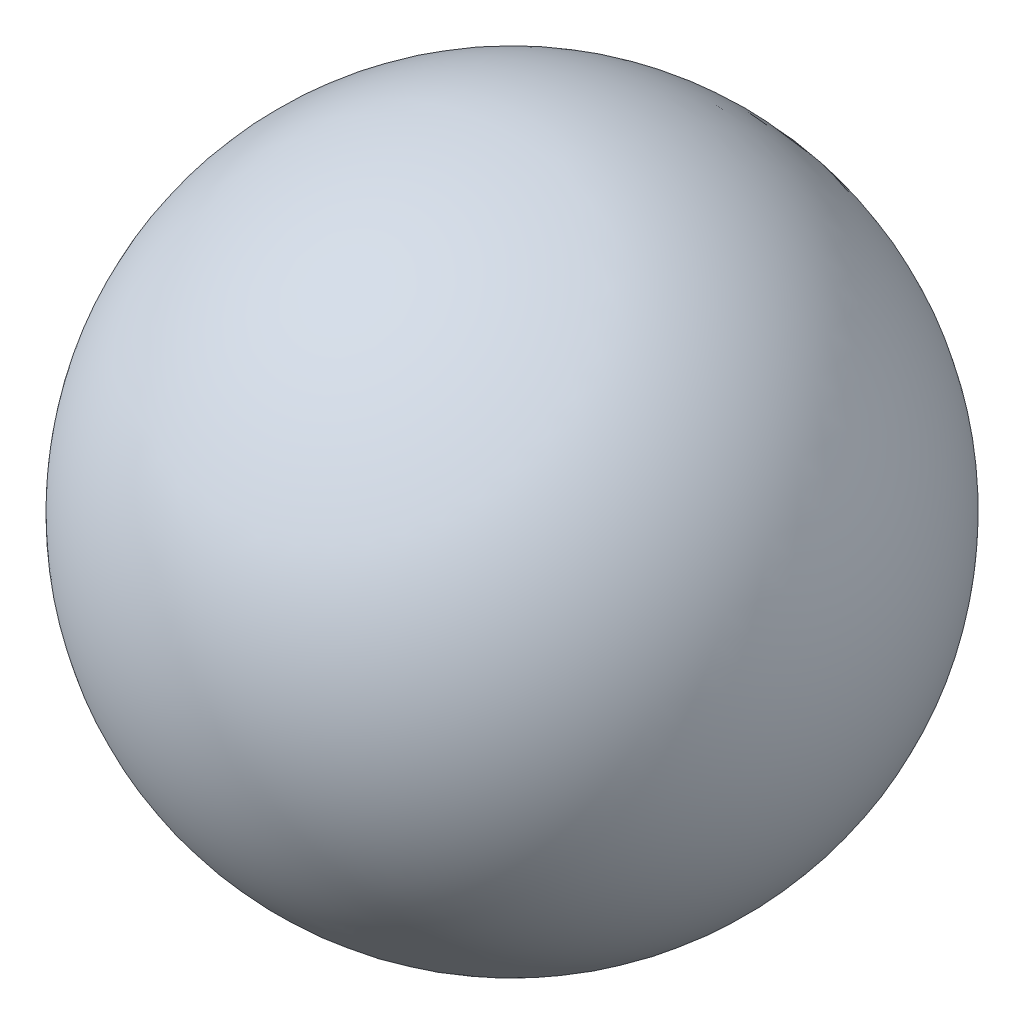
ISO-10303-21;
HEADER;
FILE_DESCRIPTION(('STEP AP214'),'2;1');
FILE_NAME('part.step','',(''),(''),'','','');
FILE_SCHEMA(('AUTOMOTIVE_DESIGN { 1 0 10303 214 1 1 1 1 }'));
ENDSEC;
DATA;
#1=APPLICATION_CONTEXT('core data for automotive mechanical design processes');
#2=APPLICATION_PROTOCOL_DEFINITION('international standard','automotive_design',2000,#1);
#3=PRODUCT_CONTEXT('',#1,'mechanical');
#4=PRODUCT('Part','Part','',(#3));
#5=PRODUCT_RELATED_PRODUCT_CATEGORY('part','',(#4));
#6=PRODUCT_DEFINITION_FORMATION('','',#4);
#7=PRODUCT_DEFINITION_CONTEXT('part definition',#1,'design');
#8=PRODUCT_DEFINITION('design','',#6,#7);
#9=PRODUCT_DEFINITION_SHAPE('','',#8);
#10=(LENGTH_UNIT() NAMED_UNIT(*) SI_UNIT(.MILLI.,.METRE.));
#11=(NAMED_UNIT(*) PLANE_ANGLE_UNIT() SI_UNIT($,.RADIAN.));
#12=(NAMED_UNIT(*) SI_UNIT($,.STERADIAN.) SOLID_ANGLE_UNIT());
#13=UNCERTAINTY_MEASURE_WITH_UNIT(LENGTH_MEASURE(1.E-05),#10,'distance_accuracy_value','');
#14=(GEOMETRIC_REPRESENTATION_CONTEXT(3) GLOBAL_UNCERTAINTY_ASSIGNED_CONTEXT((#13)) GLOBAL_UNIT_ASSIGNED_CONTEXT((#10,
#11,#12)) REPRESENTATION_CONTEXT('',''));
#15=CARTESIAN_POINT('',(0.,0.,0.));
#16=DIRECTION('',(0.,0.,1.));
#17=DIRECTION('',(1.,0.,0.));
#18=AXIS2_PLACEMENT_3D('',#15,#16,#17);
#19=CARTESIAN_POINT('',(57.535,-31.5107761467009,-52.850699890186));
#20=DIRECTION('',(0.,-0.512108044606437,-0.85892103865802));
#21=DIRECTION('',(0.173648177666934,0.845872098095716,-0.504327972708341));
#22=AXIS2_PLACEMENT_3D('',#19,#20,#21);
#23=SPHERICAL_SURFACE('',#22,6.75);
#24=CARTESIAN_POINT('',(57.535,-34.9675054477943,-58.6484169011276));
#25=VERTEX_POINT('',#24);
#26=VERTEX_LOOP('',#25);
#27=FACE_BOUND('',#26,.T.);
#28=CARTESIAN_POINT('',(57.535,-28.0540468456074,-47.0529828792444));
#29=VERTEX_POINT('',#28);
#30=VERTEX_LOOP('',#29);
#31=FACE_BOUND('',#30,.T.);
#32=ADVANCED_FACE('F16',(#27,#31),#23,.T.);
#33=CLOSED_SHELL('',(#32));
#34=MANIFOLD_SOLID_BREP('B1',#33);
#35=ADVANCED_BREP_SHAPE_REPRESENTATION('',(#18,#34),#14);
#36=SHAPE_DEFINITION_REPRESENTATION(#9,#35);
ENDSEC;
END-ISO-10303-21;
